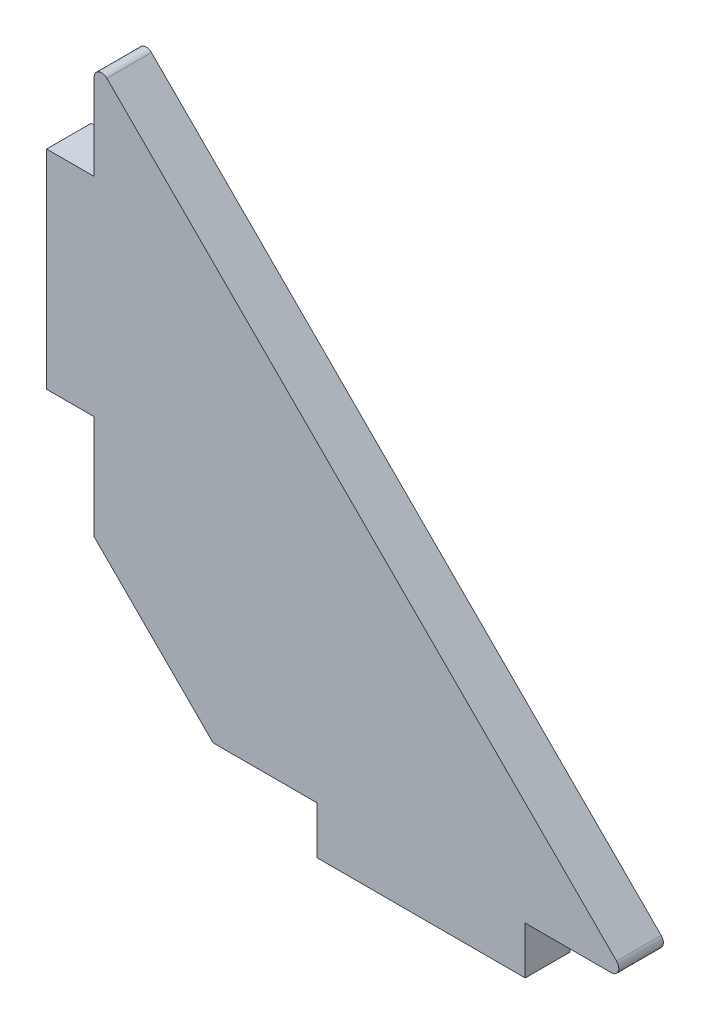
ISO-10303-21;
HEADER;
FILE_DESCRIPTION(('STEP AP214'),'2;1');
FILE_NAME('part.step','',(''),(''),'','','');
FILE_SCHEMA(('AUTOMOTIVE_DESIGN { 1 0 10303 214 1 1 1 1 }'));
ENDSEC;
DATA;
#1=APPLICATION_CONTEXT('core data for automotive mechanical design processes');
#2=APPLICATION_PROTOCOL_DEFINITION('international standard','automotive_design',2000,#1);
#3=PRODUCT_CONTEXT('',#1,'mechanical');
#4=PRODUCT('Part','Part','',(#3));
#5=PRODUCT_RELATED_PRODUCT_CATEGORY('part','',(#4));
#6=PRODUCT_DEFINITION_FORMATION('','',#4);
#7=PRODUCT_DEFINITION_CONTEXT('part definition',#1,'design');
#8=PRODUCT_DEFINITION('design','',#6,#7);
#9=PRODUCT_DEFINITION_SHAPE('','',#8);
#10=(LENGTH_UNIT() NAMED_UNIT(*) SI_UNIT(.MILLI.,.METRE.));
#11=(NAMED_UNIT(*) PLANE_ANGLE_UNIT() SI_UNIT($,.RADIAN.));
#12=(NAMED_UNIT(*) SI_UNIT($,.STERADIAN.) SOLID_ANGLE_UNIT());
#13=UNCERTAINTY_MEASURE_WITH_UNIT(LENGTH_MEASURE(1.E-05),#10,'distance_accuracy_value','');
#14=(GEOMETRIC_REPRESENTATION_CONTEXT(3) GLOBAL_UNCERTAINTY_ASSIGNED_CONTEXT((#13)) GLOBAL_UNIT_ASSIGNED_CONTEXT((#10,
#11,#12)) REPRESENTATION_CONTEXT('',''));
#15=CARTESIAN_POINT('',(0.,0.,0.));
#16=DIRECTION('',(0.,0.,1.));
#17=DIRECTION('',(1.,0.,0.));
#18=AXIS2_PLACEMENT_3D('',#15,#16,#17);
#19=CARTESIAN_POINT('',(0.,8.,-3.));
#20=DIRECTION('',(-1.,0.,0.));
#21=DIRECTION('',(0.,0.,1.));
#22=AXIS2_PLACEMENT_3D('',#19,#20,#21);
#23=PLANE('',#22);
#24=DIRECTION('',(0.,-1.,0.));
#25=VECTOR('',#24,1.);
#26=CARTESIAN_POINT('',(0.,8.,0.));
#27=LINE('',#26,#25);
#28=CARTESIAN_POINT('',(0.,34.7928932188132,0.));
#29=VERTEX_POINT('',#28);
#30=CARTESIAN_POINT('',(0.,29.0000000000001,0.));
#31=VERTEX_POINT('',#30);
#32=EDGE_CURVE('E198',#29,#31,#27,.T.);
#33=ORIENTED_EDGE('',*,*,#32,.F.);
#34=DIRECTION('',(0.,0.,1.));
#35=VECTOR('',#34,1.);
#36=CARTESIAN_POINT('',(0.,34.7928932188132,-3.));
#37=LINE('',#36,#35);
#38=CARTESIAN_POINT('',(0.,34.7928932188132,-3.));
#39=VERTEX_POINT('',#38);
#40=EDGE_CURVE('E11',#29,#39,#37,.F.);
#41=ORIENTED_EDGE('',*,*,#40,.T.);
#42=DIRECTION('',(0.,-1.,0.));
#43=VECTOR('',#42,1.);
#44=CARTESIAN_POINT('',(0.,8.,-3.));
#45=LINE('',#44,#43);
#46=CARTESIAN_POINT('',(-1.04083408558608E-13,29.0000000000001,-3.));
#47=VERTEX_POINT('',#46);
#48=EDGE_CURVE('E174',#39,#47,#45,.T.);
#49=ORIENTED_EDGE('',*,*,#48,.T.);
#50=DIRECTION('',(0.,0.,1.));
#51=VECTOR('',#50,1.);
#52=CARTESIAN_POINT('',(-1.04083408558608E-13,29.0000000000001,-3.));
#53=LINE('',#52,#51);
#54=EDGE_CURVE('E165',#47,#31,#53,.T.);
#55=ORIENTED_EDGE('',*,*,#54,.T.);
#56=EDGE_LOOP('',(#33,#41,#49,#55));
#57=FACE_BOUND('',#56,.T.);
#58=ADVANCED_FACE('F42',(#57),#23,.T.);
#59=CARTESIAN_POINT('',(36.0000000000001,0.,-3.));
#60=DIRECTION('',(0.,-1.,0.));
#61=DIRECTION('',(1.,0.,0.));
#62=AXIS2_PLACEMENT_3D('',#59,#60,#61);
#63=PLANE('',#62);
#64=DIRECTION('',(1.,0.,0.));
#65=VECTOR('',#64,1.);
#66=CARTESIAN_POINT('',(36.0000000000001,0.,-3.));
#67=LINE('',#66,#65);
#68=CARTESIAN_POINT('',(8.00000000000009,0.,-3.));
#69=VERTEX_POINT('',#68);
#70=CARTESIAN_POINT('',(15.0000000000001,0.,-3.));
#71=VERTEX_POINT('',#70);
#72=EDGE_CURVE('E191',#69,#71,#67,.T.);
#73=ORIENTED_EDGE('',*,*,#72,.T.);
#74=DIRECTION('',(0.,0.,1.));
#75=VECTOR('',#74,1.);
#76=CARTESIAN_POINT('',(15.0000000000001,0.,-3.));
#77=LINE('',#76,#75);
#78=CARTESIAN_POINT('',(15.0000000000001,0.,0.));
#79=VERTEX_POINT('',#78);
#80=EDGE_CURVE('E292',#71,#79,#77,.T.);
#81=ORIENTED_EDGE('',*,*,#80,.T.);
#82=DIRECTION('',(1.,0.,0.));
#83=VECTOR('',#82,1.);
#84=CARTESIAN_POINT('',(36.0000000000001,0.,0.));
#85=LINE('',#84,#83);
#86=CARTESIAN_POINT('',(8.00000000000009,0.,0.));
#87=VERTEX_POINT('',#86);
#88=EDGE_CURVE('E182',#87,#79,#85,.T.);
#89=ORIENTED_EDGE('',*,*,#88,.F.);
#90=DIRECTION('',(0.,0.,1.));
#91=VECTOR('',#90,1.);
#92=CARTESIAN_POINT('',(8.00000000000009,0.,-3.));
#93=LINE('',#92,#91);
#94=EDGE_CURVE('E209',#69,#87,#93,.T.);
#95=ORIENTED_EDGE('',*,*,#94,.F.);
#96=EDGE_LOOP('',(#73,#81,#89,#95));
#97=FACE_BOUND('',#96,.T.);
#98=ADVANCED_FACE('F311',(#97),#63,.T.);
#99=DIRECTION('',(0.,0.,1.));
#100=VECTOR('',#99,1.);
#101=CARTESIAN_POINT('',(0.,15.0000000000001,-3.));
#102=LINE('',#101,#100);
#103=CARTESIAN_POINT('',(0.,15.0000000000001,-3.));
#104=VERTEX_POINT('',#103);
#105=CARTESIAN_POINT('',(0.,15.0000000000001,0.));
#106=VERTEX_POINT('',#105);
#107=EDGE_CURVE('E147',#104,#106,#102,.T.);
#108=ORIENTED_EDGE('',*,*,#107,.F.);
#109=CARTESIAN_POINT('',(0.,8.,-3.));
#110=VERTEX_POINT('',#109);
#111=EDGE_CURVE('E161',#104,#110,#45,.T.);
#112=ORIENTED_EDGE('',*,*,#111,.T.);
#113=DIRECTION('',(0.,0.,1.));
#114=VECTOR('',#113,1.);
#115=CARTESIAN_POINT('',(0.,8.,-3.));
#116=LINE('',#115,#114);
#117=CARTESIAN_POINT('',(0.,8.,0.));
#118=VERTEX_POINT('',#117);
#119=EDGE_CURVE('E197',#110,#118,#116,.T.);
#120=ORIENTED_EDGE('',*,*,#119,.T.);
#121=EDGE_CURVE('E163',#106,#118,#27,.T.);
#122=ORIENTED_EDGE('',*,*,#121,.F.);
#123=EDGE_LOOP('',(#108,#112,#120,#122));
#124=FACE_BOUND('',#123,.T.);
#125=ADVANCED_FACE('F159',(#124),#23,.T.);
#126=CARTESIAN_POINT('',(0.,35.9999999999997,-3.));
#127=DIRECTION('',(0.707106781186544,0.707106781186551,0.));
#128=DIRECTION('',(-0.707106781186551,0.707106781186544,0.));
#129=AXIS2_PLACEMENT_3D('',#126,#127,#128);
#130=PLANE('',#129);
#131=DIRECTION('',(-0.707106781186551,0.707106781186544,0.));
#132=VECTOR('',#131,1.);
#133=CARTESIAN_POINT('',(0.,35.9999999999997,0.));
#134=LINE('',#133,#132);
#135=CARTESIAN_POINT('',(35.1464466094068,0.85355339059328,0.));
#136=VERTEX_POINT('',#135);
#137=CARTESIAN_POINT('',(0.853553390593269,35.1464466094064,0.));
#138=VERTEX_POINT('',#137);
#139=EDGE_CURVE('E175',#136,#138,#134,.T.);
#140=ORIENTED_EDGE('',*,*,#139,.F.);
#141=DIRECTION('',(0.,0.,1.));
#142=VECTOR('',#141,1.);
#143=CARTESIAN_POINT('',(35.1464466094068,0.85355339059328,-3.));
#144=LINE('',#143,#142);
#145=CARTESIAN_POINT('',(35.1464466094068,0.85355339059328,-3.));
#146=VERTEX_POINT('',#145);
#147=EDGE_CURVE('E228',#136,#146,#144,.F.);
#148=ORIENTED_EDGE('',*,*,#147,.T.);
#149=DIRECTION('',(-0.707106781186551,0.707106781186544,0.));
#150=VECTOR('',#149,1.);
#151=CARTESIAN_POINT('',(0.,35.9999999999997,-3.));
#152=LINE('',#151,#150);
#153=CARTESIAN_POINT('',(0.853553390593269,35.1464466094064,-3.));
#154=VERTEX_POINT('',#153);
#155=EDGE_CURVE('E195',#146,#154,#152,.T.);
#156=ORIENTED_EDGE('',*,*,#155,.T.);
#157=DIRECTION('',(0.,0.,1.));
#158=VECTOR('',#157,1.);
#159=CARTESIAN_POINT('',(0.853553390593269,35.1464466094064,-3.));
#160=LINE('',#159,#158);
#161=EDGE_CURVE('E224',#154,#138,#160,.T.);
#162=ORIENTED_EDGE('',*,*,#161,.T.);
#163=EDGE_LOOP('',(#140,#148,#156,#162));
#164=FACE_BOUND('',#163,.T.);
#165=ADVANCED_FACE('F254',(#164),#130,.T.);
#166=CARTESIAN_POINT('',(29.0000000000001,0.,-3.));
#167=VERTEX_POINT('',#166);
#168=CARTESIAN_POINT('',(34.7928932188135,0.,-3.));
#169=VERTEX_POINT('',#168);
#170=EDGE_CURVE('E190',#167,#169,#67,.T.);
#171=ORIENTED_EDGE('',*,*,#170,.T.);
#172=DIRECTION('',(0.,0.,1.));
#173=VECTOR('',#172,1.);
#174=CARTESIAN_POINT('',(34.7928932188135,0.,-3.));
#175=LINE('',#174,#173);
#176=CARTESIAN_POINT('',(34.7928932188135,0.,0.));
#177=VERTEX_POINT('',#176);
#178=EDGE_CURVE('E212',#169,#177,#175,.T.);
#179=ORIENTED_EDGE('',*,*,#178,.T.);
#180=CARTESIAN_POINT('',(29.0000000000001,0.,0.));
#181=VERTEX_POINT('',#180);
#182=EDGE_CURVE('E205',#181,#177,#85,.T.);
#183=ORIENTED_EDGE('',*,*,#182,.F.);
#184=DIRECTION('',(0.,0.,1.));
#185=VECTOR('',#184,1.);
#186=CARTESIAN_POINT('',(29.0000000000001,0.,-3.));
#187=LINE('',#186,#185);
#188=EDGE_CURVE('E246',#167,#181,#187,.T.);
#189=ORIENTED_EDGE('',*,*,#188,.F.);
#190=EDGE_LOOP('',(#171,#179,#183,#189));
#191=FACE_BOUND('',#190,.T.);
#192=ADVANCED_FACE('F243',(#191),#63,.T.);
#193=CARTESIAN_POINT('',(8.00000000000009,0.,-3.));
#194=DIRECTION('',(-0.707106781186543,-0.707106781186552,0.));
#195=DIRECTION('',(0.707106781186552,-0.707106781186543,0.));
#196=AXIS2_PLACEMENT_3D('',#193,#194,#195);
#197=PLANE('',#196);
#198=DIRECTION('',(0.707106781186552,-0.707106781186543,0.));
#199=VECTOR('',#198,1.);
#200=CARTESIAN_POINT('',(8.00000000000009,0.,0.));
#201=LINE('',#200,#199);
#202=EDGE_CURVE('E201',#118,#87,#201,.T.);
#203=ORIENTED_EDGE('',*,*,#202,.F.);
#204=ORIENTED_EDGE('',*,*,#119,.F.);
#205=DIRECTION('',(0.707106781186552,-0.707106781186543,0.));
#206=VECTOR('',#205,1.);
#207=CARTESIAN_POINT('',(8.00000000000009,0.,-3.));
#208=LINE('',#207,#206);
#209=EDGE_CURVE('E172',#110,#69,#208,.T.);
#210=ORIENTED_EDGE('',*,*,#209,.T.);
#211=ORIENTED_EDGE('',*,*,#94,.T.);
#212=EDGE_LOOP('',(#203,#204,#210,#211));
#213=FACE_BOUND('',#212,.T.);
#214=ADVANCED_FACE('F355',(#213),#197,.T.);
#215=CARTESIAN_POINT('',(0.,0.,-3.));
#216=DIRECTION('',(0.,0.,1.));
#217=DIRECTION('',(1.,0.,0.));
#218=AXIS2_PLACEMENT_3D('',#215,#216,#217);
#219=PLANE('',#218);
#220=ORIENTED_EDGE('',*,*,#155,.F.);
#221=CARTESIAN_POINT('',(34.7928932188135,0.5,-3.));
#222=DIRECTION('',(0.,0.,1.));
#223=DIRECTION('',(1.,0.,0.));
#224=AXIS2_PLACEMENT_3D('',#221,#222,#223);
#225=CIRCLE('',#224,0.5);
#226=EDGE_CURVE('E51',#146,#169,#225,.F.);
#227=ORIENTED_EDGE('',*,*,#226,.T.);
#228=ORIENTED_EDGE('',*,*,#170,.F.);
#229=DIRECTION('',(0.,1.,0.));
#230=VECTOR('',#229,1.);
#231=CARTESIAN_POINT('',(29.0000000000001,0.,-3.));
#232=LINE('',#231,#230);
#233=CARTESIAN_POINT('',(29.0000000000001,-3.2,-3.));
#234=VERTEX_POINT('',#233);
#235=EDGE_CURVE('E280',#234,#167,#232,.T.);
#236=ORIENTED_EDGE('',*,*,#235,.F.);
#237=DIRECTION('',(1.,0.,0.));
#238=VECTOR('',#237,1.);
#239=CARTESIAN_POINT('',(15.0000000000001,-3.2,-3.));
#240=LINE('',#239,#238);
#241=CARTESIAN_POINT('',(15.0000000000001,-3.2,-3.));
#242=VERTEX_POINT('',#241);
#243=EDGE_CURVE('E275',#242,#234,#240,.T.);
#244=ORIENTED_EDGE('',*,*,#243,.F.);
#245=DIRECTION('',(0.,-1.,0.));
#246=VECTOR('',#245,1.);
#247=CARTESIAN_POINT('',(15.0000000000001,0.,-3.));
#248=LINE('',#247,#246);
#249=EDGE_CURVE('E271',#71,#242,#248,.T.);
#250=ORIENTED_EDGE('',*,*,#249,.F.);
#251=ORIENTED_EDGE('',*,*,#72,.F.);
#252=ORIENTED_EDGE('',*,*,#209,.F.);
#253=ORIENTED_EDGE('',*,*,#111,.F.);
#254=DIRECTION('',(1.,0.,0.));
#255=VECTOR('',#254,1.);
#256=CARTESIAN_POINT('',(0.,15.0000000000001,-3.));
#257=LINE('',#256,#255);
#258=CARTESIAN_POINT('',(-3.20000000000005,15.0000000000001,-3.));
#259=VERTEX_POINT('',#258);
#260=EDGE_CURVE('E143',#259,#104,#257,.T.);
#261=ORIENTED_EDGE('',*,*,#260,.F.);
#262=DIRECTION('',(0.,-1.,0.));
#263=VECTOR('',#262,1.);
#264=CARTESIAN_POINT('',(-3.20000000000005,15.0000000000001,-3.));
#265=LINE('',#264,#263);
#266=CARTESIAN_POINT('',(-3.2000000000001,29.0000000000001,-3.));
#267=VERTEX_POINT('',#266);
#268=EDGE_CURVE('E166',#267,#259,#265,.T.);
#269=ORIENTED_EDGE('',*,*,#268,.F.);
#270=DIRECTION('',(-1.,0.,0.));
#271=VECTOR('',#270,1.);
#272=CARTESIAN_POINT('',(-1.04083408558608E-13,29.0000000000001,-3.));
#273=LINE('',#272,#271);
#274=EDGE_CURVE('E154',#47,#267,#273,.T.);
#275=ORIENTED_EDGE('',*,*,#274,.F.);
#276=ORIENTED_EDGE('',*,*,#48,.F.);
#277=CARTESIAN_POINT('',(0.5,34.7928932188132,-3.));
#278=DIRECTION('',(0.,0.,1.));
#279=DIRECTION('',(1.,0.,0.));
#280=AXIS2_PLACEMENT_3D('',#277,#278,#279);
#281=CIRCLE('',#280,0.5);
#282=EDGE_CURVE('E63',#39,#154,#281,.F.);
#283=ORIENTED_EDGE('',*,*,#282,.T.);
#284=EDGE_LOOP('',(#220,#227,#228,#236,#244,#250,#251,#252,#253,#261,#269,#275,#276,#283));
#285=FACE_BOUND('',#284,.T.);
#286=ADVANCED_FACE('F169',(#285),#219,.F.);
#287=CARTESIAN_POINT('',(0.,0.,0.));
#288=DIRECTION('',(0.,0.,1.));
#289=DIRECTION('',(1.,0.,0.));
#290=AXIS2_PLACEMENT_3D('',#287,#288,#289);
#291=PLANE('',#290);
#292=ORIENTED_EDGE('',*,*,#182,.T.);
#293=CARTESIAN_POINT('',(34.7928932188135,0.5,0.));
#294=DIRECTION('',(0.,0.,1.));
#295=DIRECTION('',(1.,0.,0.));
#296=AXIS2_PLACEMENT_3D('',#293,#294,#295);
#297=CIRCLE('',#296,0.5);
#298=EDGE_CURVE('E221',#177,#136,#297,.T.);
#299=ORIENTED_EDGE('',*,*,#298,.T.);
#300=ORIENTED_EDGE('',*,*,#139,.T.);
#301=CARTESIAN_POINT('',(0.5,34.7928932188132,0.));
#302=DIRECTION('',(0.,0.,1.));
#303=DIRECTION('',(1.,0.,0.));
#304=AXIS2_PLACEMENT_3D('',#301,#302,#303);
#305=CIRCLE('',#304,0.5);
#306=EDGE_CURVE('E218',#138,#29,#305,.T.);
#307=ORIENTED_EDGE('',*,*,#306,.T.);
#308=ORIENTED_EDGE('',*,*,#32,.T.);
#309=DIRECTION('',(-1.,0.,0.));
#310=VECTOR('',#309,1.);
#311=CARTESIAN_POINT('',(-1.04083408558608E-13,29.0000000000001,0.));
#312=LINE('',#311,#310);
#313=CARTESIAN_POINT('',(-3.2000000000001,29.0000000000001,0.));
#314=VERTEX_POINT('',#313);
#315=EDGE_CURVE('E323',#31,#314,#312,.T.);
#316=ORIENTED_EDGE('',*,*,#315,.T.);
#317=DIRECTION('',(0.,-1.,0.));
#318=VECTOR('',#317,1.);
#319=CARTESIAN_POINT('',(-3.20000000000005,15.0000000000001,0.));
#320=LINE('',#319,#318);
#321=CARTESIAN_POINT('',(-3.20000000000005,15.0000000000001,0.));
#322=VERTEX_POINT('',#321);
#323=EDGE_CURVE('E155',#314,#322,#320,.T.);
#324=ORIENTED_EDGE('',*,*,#323,.T.);
#325=DIRECTION('',(1.,0.,0.));
#326=VECTOR('',#325,1.);
#327=CARTESIAN_POINT('',(0.,15.0000000000001,0.));
#328=LINE('',#327,#326);
#329=EDGE_CURVE('E320',#322,#106,#328,.T.);
#330=ORIENTED_EDGE('',*,*,#329,.T.);
#331=ORIENTED_EDGE('',*,*,#121,.T.);
#332=ORIENTED_EDGE('',*,*,#202,.T.);
#333=ORIENTED_EDGE('',*,*,#88,.T.);
#334=DIRECTION('',(0.,-1.,0.));
#335=VECTOR('',#334,1.);
#336=CARTESIAN_POINT('',(15.0000000000001,0.,0.));
#337=LINE('',#336,#335);
#338=CARTESIAN_POINT('',(15.0000000000001,-3.2,0.));
#339=VERTEX_POINT('',#338);
#340=EDGE_CURVE('E283',#79,#339,#337,.T.);
#341=ORIENTED_EDGE('',*,*,#340,.T.);
#342=DIRECTION('',(1.,0.,0.));
#343=VECTOR('',#342,1.);
#344=CARTESIAN_POINT('',(15.0000000000001,-3.2,0.));
#345=LINE('',#344,#343);
#346=CARTESIAN_POINT('',(29.0000000000001,-3.2,0.));
#347=VERTEX_POINT('',#346);
#348=EDGE_CURVE('E286',#339,#347,#345,.T.);
#349=ORIENTED_EDGE('',*,*,#348,.T.);
#350=DIRECTION('',(0.,1.,0.));
#351=VECTOR('',#350,1.);
#352=CARTESIAN_POINT('',(29.0000000000001,0.,0.));
#353=LINE('',#352,#351);
#354=EDGE_CURVE('E276',#347,#181,#353,.T.);
#355=ORIENTED_EDGE('',*,*,#354,.T.);
#356=EDGE_LOOP('',(#292,#299,#300,#307,#308,#316,#324,#330,#331,#332,#333,#341,#349,#355));
#357=FACE_BOUND('',#356,.T.);
#358=ADVANCED_FACE('F251',(#357),#291,.T.);
#359=CARTESIAN_POINT('',(15.0000000000001,0.,-3.));
#360=DIRECTION('',(-1.,0.,0.));
#361=DIRECTION('',(0.,-1.,0.));
#362=AXIS2_PLACEMENT_3D('',#359,#360,#361);
#363=PLANE('',#362);
#364=ORIENTED_EDGE('',*,*,#340,.F.);
#365=ORIENTED_EDGE('',*,*,#80,.F.);
#366=ORIENTED_EDGE('',*,*,#249,.T.);
#367=DIRECTION('',(0.,0.,1.));
#368=VECTOR('',#367,1.);
#369=CARTESIAN_POINT('',(15.0000000000001,-3.2,-3.));
#370=LINE('',#369,#368);
#371=EDGE_CURVE('E186',#242,#339,#370,.T.);
#372=ORIENTED_EDGE('',*,*,#371,.T.);
#373=EDGE_LOOP('',(#364,#365,#366,#372));
#374=FACE_BOUND('',#373,.T.);
#375=ADVANCED_FACE('F304',(#374),#363,.T.);
#376=CARTESIAN_POINT('',(29.0000000000001,0.,-3.));
#377=DIRECTION('',(1.,0.,0.));
#378=DIRECTION('',(0.,1.,0.));
#379=AXIS2_PLACEMENT_3D('',#376,#377,#378);
#380=PLANE('',#379);
#381=ORIENTED_EDGE('',*,*,#354,.F.);
#382=DIRECTION('',(0.,0.,1.));
#383=VECTOR('',#382,1.);
#384=CARTESIAN_POINT('',(29.0000000000001,-3.2,-3.));
#385=LINE('',#384,#383);
#386=EDGE_CURVE('E297',#234,#347,#385,.T.);
#387=ORIENTED_EDGE('',*,*,#386,.F.);
#388=ORIENTED_EDGE('',*,*,#235,.T.);
#389=ORIENTED_EDGE('',*,*,#188,.T.);
#390=EDGE_LOOP('',(#381,#387,#388,#389));
#391=FACE_BOUND('',#390,.T.);
#392=ADVANCED_FACE('F313',(#391),#380,.T.);
#393=CARTESIAN_POINT('',(15.0000000000001,-3.2,-3.));
#394=DIRECTION('',(0.,-1.,0.));
#395=DIRECTION('',(1.,0.,0.));
#396=AXIS2_PLACEMENT_3D('',#393,#394,#395);
#397=PLANE('',#396);
#398=ORIENTED_EDGE('',*,*,#348,.F.);
#399=ORIENTED_EDGE('',*,*,#371,.F.);
#400=ORIENTED_EDGE('',*,*,#243,.T.);
#401=ORIENTED_EDGE('',*,*,#386,.T.);
#402=EDGE_LOOP('',(#398,#399,#400,#401));
#403=FACE_BOUND('',#402,.T.);
#404=ADVANCED_FACE('F307',(#403),#397,.T.);
#405=CARTESIAN_POINT('',(0.,15.0000000000001,-3.));
#406=DIRECTION('',(0.,-1.,0.));
#407=DIRECTION('',(1.,0.,0.));
#408=AXIS2_PLACEMENT_3D('',#405,#406,#407);
#409=PLANE('',#408);
#410=ORIENTED_EDGE('',*,*,#329,.F.);
#411=DIRECTION('',(0.,0.,1.));
#412=VECTOR('',#411,1.);
#413=CARTESIAN_POINT('',(-3.20000000000005,15.0000000000001,-3.));
#414=LINE('',#413,#412);
#415=EDGE_CURVE('E149',#259,#322,#414,.T.);
#416=ORIENTED_EDGE('',*,*,#415,.F.);
#417=ORIENTED_EDGE('',*,*,#260,.T.);
#418=ORIENTED_EDGE('',*,*,#107,.T.);
#419=EDGE_LOOP('',(#410,#416,#417,#418));
#420=FACE_BOUND('',#419,.T.);
#421=ADVANCED_FACE('F146',(#420),#409,.T.);
#422=CARTESIAN_POINT('',(-3.20000000000005,15.0000000000001,-3.));
#423=DIRECTION('',(-1.,0.,0.));
#424=DIRECTION('',(0.,-1.,0.));
#425=AXIS2_PLACEMENT_3D('',#422,#423,#424);
#426=PLANE('',#425);
#427=ORIENTED_EDGE('',*,*,#323,.F.);
#428=DIRECTION('',(0.,0.,1.));
#429=VECTOR('',#428,1.);
#430=CARTESIAN_POINT('',(-3.2000000000001,29.0000000000001,-3.));
#431=LINE('',#430,#429);
#432=EDGE_CURVE('E264',#267,#314,#431,.T.);
#433=ORIENTED_EDGE('',*,*,#432,.F.);
#434=ORIENTED_EDGE('',*,*,#268,.T.);
#435=ORIENTED_EDGE('',*,*,#415,.T.);
#436=EDGE_LOOP('',(#427,#433,#434,#435));
#437=FACE_BOUND('',#436,.T.);
#438=ADVANCED_FACE('F330',(#437),#426,.T.);
#439=CARTESIAN_POINT('',(-1.04083408558608E-13,29.0000000000001,-3.));
#440=DIRECTION('',(0.,1.,0.));
#441=DIRECTION('',(-1.,0.,0.));
#442=AXIS2_PLACEMENT_3D('',#439,#440,#441);
#443=PLANE('',#442);
#444=ORIENTED_EDGE('',*,*,#315,.F.);
#445=ORIENTED_EDGE('',*,*,#54,.F.);
#446=ORIENTED_EDGE('',*,*,#274,.T.);
#447=ORIENTED_EDGE('',*,*,#432,.T.);
#448=EDGE_LOOP('',(#444,#445,#446,#447));
#449=FACE_BOUND('',#448,.T.);
#450=ADVANCED_FACE('F331',(#449),#443,.T.);
#451=CARTESIAN_POINT('',(34.7928932188135,0.5,-3.));
#452=DIRECTION('',(0.,0.,1.));
#453=DIRECTION('',(1.,0.,0.));
#454=AXIS2_PLACEMENT_3D('',#451,#452,#453);
#455=CYLINDRICAL_SURFACE('',#454,0.5);
#456=ORIENTED_EDGE('',*,*,#226,.F.);
#457=ORIENTED_EDGE('',*,*,#147,.F.);
#458=ORIENTED_EDGE('',*,*,#298,.F.);
#459=ORIENTED_EDGE('',*,*,#178,.F.);
#460=EDGE_LOOP('',(#456,#457,#458,#459));
#461=FACE_BOUND('',#460,.T.);
#462=ADVANCED_FACE('F248',(#461),#455,.T.);
#463=CARTESIAN_POINT('',(0.5,34.7928932188132,-3.));
#464=DIRECTION('',(0.,0.,1.));
#465=DIRECTION('',(1.,0.,0.));
#466=AXIS2_PLACEMENT_3D('',#463,#464,#465);
#467=CYLINDRICAL_SURFACE('',#466,0.5);
#468=ORIENTED_EDGE('',*,*,#282,.F.);
#469=ORIENTED_EDGE('',*,*,#40,.F.);
#470=ORIENTED_EDGE('',*,*,#306,.F.);
#471=ORIENTED_EDGE('',*,*,#161,.F.);
#472=EDGE_LOOP('',(#468,#469,#470,#471));
#473=FACE_BOUND('',#472,.T.);
#474=ADVANCED_FACE('F44',(#473),#467,.T.);
#475=CLOSED_SHELL('',(#58,#98,#125,#165,#192,#214,#286,#358,#375,#392,#404,#421,#438,#450,#462,#474));
#476=MANIFOLD_SOLID_BREP('B2',#475);
#477=ADVANCED_BREP_SHAPE_REPRESENTATION('',(#18,#476),#14);
#478=SHAPE_DEFINITION_REPRESENTATION(#9,#477);
ENDSEC;
END-ISO-10303-21;
